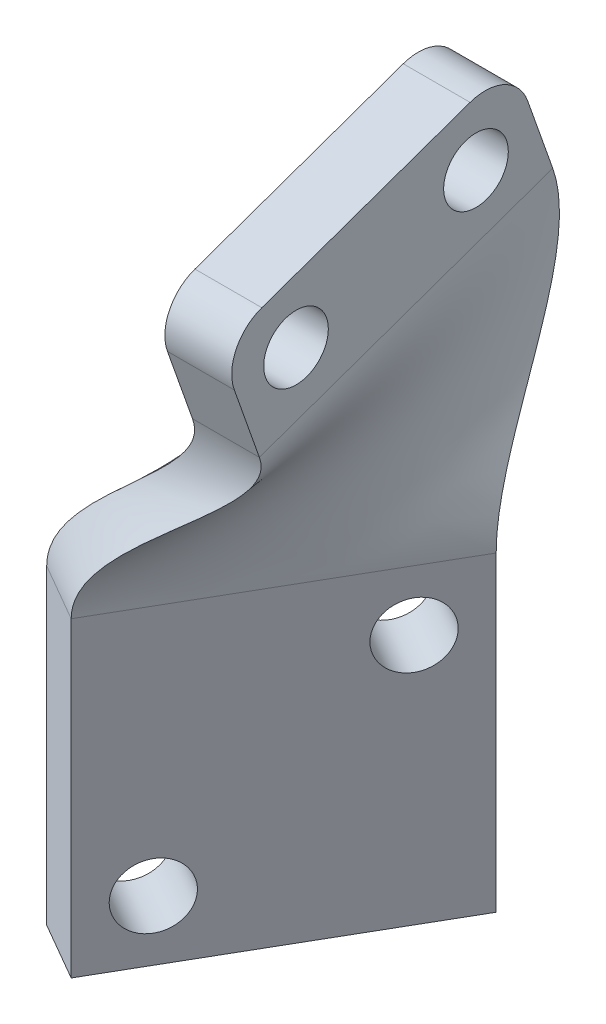
ISO-10303-21;
HEADER;
FILE_DESCRIPTION(('STEP AP214'),'2;1');
FILE_NAME('part.step','',(''),(''),'','','');
FILE_SCHEMA(('AUTOMOTIVE_DESIGN { 1 0 10303 214 1 1 1 1 }'));
ENDSEC;
DATA;
#1=APPLICATION_CONTEXT('core data for automotive mechanical design processes');
#2=APPLICATION_PROTOCOL_DEFINITION('international standard','automotive_design',2000,#1);
#3=PRODUCT_CONTEXT('',#1,'mechanical');
#4=PRODUCT('Part','Part','',(#3));
#5=PRODUCT_RELATED_PRODUCT_CATEGORY('part','',(#4));
#6=PRODUCT_DEFINITION_FORMATION('','',#4);
#7=PRODUCT_DEFINITION_CONTEXT('part definition',#1,'design');
#8=PRODUCT_DEFINITION('design','',#6,#7);
#9=PRODUCT_DEFINITION_SHAPE('','',#8);
#10=(LENGTH_UNIT() NAMED_UNIT(*) SI_UNIT(.MILLI.,.METRE.));
#11=(NAMED_UNIT(*) PLANE_ANGLE_UNIT() SI_UNIT($,.RADIAN.));
#12=(NAMED_UNIT(*) SI_UNIT($,.STERADIAN.) SOLID_ANGLE_UNIT());
#13=UNCERTAINTY_MEASURE_WITH_UNIT(LENGTH_MEASURE(1.E-05),#10,'distance_accuracy_value','');
#14=(GEOMETRIC_REPRESENTATION_CONTEXT(3) GLOBAL_UNCERTAINTY_ASSIGNED_CONTEXT((#13)) GLOBAL_UNIT_ASSIGNED_CONTEXT((#10,
#11,#12)) REPRESENTATION_CONTEXT('',''));
#15=CARTESIAN_POINT('',(0.,0.,0.));
#16=DIRECTION('',(0.,0.,1.));
#17=DIRECTION('',(1.,0.,0.));
#18=AXIS2_PLACEMENT_3D('',#15,#16,#17);
#19=CARTESIAN_POINT('',(32.1308414856879,0.,18.5507499810511));
#20=DIRECTION('',(0.866025403784438,0.,0.500000000000001));
#21=DIRECTION('',(-0.500000000000001,0.,0.866025403784438));
#22=AXIS2_PLACEMENT_3D('',#19,#20,#21);
#23=PLANE('',#22);
#24=CARTESIAN_POINT('',(-20.9871698093958,18.3679349444248,110.553844341153));
#25=DIRECTION('',(-0.866025403784438,0.,-0.5));
#26=DIRECTION('',(-0.5,0.,0.866025403784438));
#27=AXIS2_PLACEMENT_3D('',#24,#25,#26);
#28=CIRCLE('',#27,2.15000000000001);
#29=CARTESIAN_POINT('',(-22.0621698093958,18.3679349444248,112.41579895929));
#30=VERTEX_POINT('',#29);
#31=EDGE_CURVE('E308',#30,#30,#28,.T.);
#32=ORIENTED_EDGE('',*,*,#31,.T.);
#33=EDGE_LOOP('',(#32));
#34=FACE_BOUND('',#33,.T.);
#35=DIRECTION('',(0.,-1.,0.));
#36=VECTOR('',#35,1.);
#37=CARTESIAN_POINT('',(-18.9871698093958,22.3679349444248,107.089742726016));
#38=LINE('',#37,#36);
#39=CARTESIAN_POINT('',(-18.9871698093958,22.3679349444248,107.089742726016));
#40=VERTEX_POINT('',#39);
#41=CARTESIAN_POINT('',(-18.9871698093958,1.66793494442471,107.089742726016));
#42=VERTEX_POINT('',#41);
#43=EDGE_CURVE('E318',#40,#42,#38,.T.);
#44=ORIENTED_EDGE('',*,*,#43,.F.);
#45=DIRECTION('',(-0.500000000000001,0.,0.866025403784438));
#46=VECTOR('',#45,1.);
#47=CARTESIAN_POINT('',(32.1308414856879,22.3679349444248,18.5507499810511));
#48=LINE('',#47,#46);
#49=CARTESIAN_POINT('',(-29.3371698093958,22.3679349444248,125.016468584354));
#50=VERTEX_POINT('',#49);
#51=EDGE_CURVE('E152',#50,#40,#48,.F.);
#52=ORIENTED_EDGE('',*,*,#51,.F.);
#53=DIRECTION('',(0.,1.,0.));
#54=VECTOR('',#53,1.);
#55=CARTESIAN_POINT('',(-29.3371698093958,22.3679349444248,125.016468584354));
#56=LINE('',#55,#54);
#57=CARTESIAN_POINT('',(-29.3371698093958,1.66793494442472,125.016468584354));
#58=VERTEX_POINT('',#57);
#59=EDGE_CURVE('E317',#58,#50,#56,.T.);
#60=ORIENTED_EDGE('',*,*,#59,.F.);
#61=DIRECTION('',(-0.500000000000001,0.,0.866025403784438));
#62=VECTOR('',#61,1.);
#63=CARTESIAN_POINT('',(-18.9871698093958,1.66793494442471,107.089742726016));
#64=LINE('',#63,#62);
#65=EDGE_CURVE('E314',#42,#58,#64,.T.);
#66=ORIENTED_EDGE('',*,*,#65,.F.);
#67=EDGE_LOOP('',(#44,#52,#60,#66));
#68=FACE_BOUND('',#67,.T.);
#69=CARTESIAN_POINT('',(-27.3371698093958,5.66793494442471,121.552366969216));
#70=DIRECTION('',(-0.866025403784438,0.,-0.5));
#71=DIRECTION('',(-0.5,0.,0.866025403784438));
#72=AXIS2_PLACEMENT_3D('',#69,#70,#71);
#73=CIRCLE('',#72,2.14999999999999);
#74=CARTESIAN_POINT('',(-28.4121698093958,5.66793494442471,123.414321587352));
#75=VERTEX_POINT('',#74);
#76=EDGE_CURVE('E296',#75,#75,#73,.T.);
#77=ORIENTED_EDGE('',*,*,#76,.T.);
#78=EDGE_LOOP('',(#77));
#79=FACE_BOUND('',#78,.T.);
#80=ADVANCED_FACE('F45',(#34,#68,#79),#23,.T.);
#81=CARTESIAN_POINT('',(28.2770284388471,0.,16.3257499810511));
#82=DIRECTION('',(0.866025403784438,0.,0.500000000000001));
#83=DIRECTION('',(-0.500000000000001,0.,0.866025403784438));
#84=AXIS2_PLACEMENT_3D('',#81,#82,#83);
#85=PLANE('',#84);
#86=DIRECTION('',(0.,-1.,0.));
#87=VECTOR('',#86,1.);
#88=CARTESIAN_POINT('',(-22.8409828562366,22.3679349444248,104.864742726016));
#89=LINE('',#88,#87);
#90=CARTESIAN_POINT('',(-22.8409828562366,22.3679349444248,104.864742726016));
#91=VERTEX_POINT('',#90);
#92=CARTESIAN_POINT('',(-22.8409828562366,1.66793494442471,104.864742726016));
#93=VERTEX_POINT('',#92);
#94=EDGE_CURVE('E311',#91,#93,#89,.T.);
#95=ORIENTED_EDGE('',*,*,#94,.T.);
#96=DIRECTION('',(-0.500000000000001,0.,0.866025403784438));
#97=VECTOR('',#96,1.);
#98=CARTESIAN_POINT('',(-22.8409828562366,1.66793494442471,104.864742726016));
#99=LINE('',#98,#97);
#100=CARTESIAN_POINT('',(-33.1909828562366,1.66793494442472,122.791468584354));
#101=VERTEX_POINT('',#100);
#102=EDGE_CURVE('E319',#93,#101,#99,.T.);
#103=ORIENTED_EDGE('',*,*,#102,.T.);
#104=DIRECTION('',(0.,1.,0.));
#105=VECTOR('',#104,1.);
#106=CARTESIAN_POINT('',(-33.1909828562366,22.3679349444248,122.791468584354));
#107=LINE('',#106,#105);
#108=CARTESIAN_POINT('',(-33.1909828562366,22.3679349444248,122.791468584354));
#109=VERTEX_POINT('',#108);
#110=EDGE_CURVE('E322',#101,#109,#107,.T.);
#111=ORIENTED_EDGE('',*,*,#110,.T.);
#112=DIRECTION('',(-0.500000000000001,0.,0.866025403784438));
#113=VECTOR('',#112,1.);
#114=CARTESIAN_POINT('',(28.2770284388471,22.3679349444248,16.3257499810511));
#115=LINE('',#114,#113);
#116=EDGE_CURVE('E330',#109,#91,#115,.F.);
#117=ORIENTED_EDGE('',*,*,#116,.T.);
#118=EDGE_LOOP('',(#95,#103,#111,#117));
#119=FACE_BOUND('',#118,.T.);
#120=CARTESIAN_POINT('',(-24.8409828562366,18.3679349444248,108.328844341153));
#121=DIRECTION('',(-0.866025403784438,0.,-0.5));
#122=DIRECTION('',(-0.5,0.,0.866025403784438));
#123=AXIS2_PLACEMENT_3D('',#120,#121,#122);
#124=CIRCLE('',#123,2.15000000000001);
#125=CARTESIAN_POINT('',(-25.9159828562366,18.3679349444248,110.19079895929));
#126=VERTEX_POINT('',#125);
#127=EDGE_CURVE('E304',#126,#126,#124,.T.);
#128=ORIENTED_EDGE('',*,*,#127,.F.);
#129=EDGE_LOOP('',(#128));
#130=FACE_BOUND('',#129,.T.);
#131=CARTESIAN_POINT('',(-31.1909828562366,5.66793494442472,119.327366969216));
#132=DIRECTION('',(-0.866025403784438,0.,-0.5));
#133=DIRECTION('',(-0.5,0.,0.866025403784438));
#134=AXIS2_PLACEMENT_3D('',#131,#132,#133);
#135=CIRCLE('',#134,2.14999999999999);
#136=CARTESIAN_POINT('',(-32.2659828562366,5.66793494442472,121.189321587352));
#137=VERTEX_POINT('',#136);
#138=EDGE_CURVE('E305',#137,#137,#135,.T.);
#139=ORIENTED_EDGE('',*,*,#138,.F.);
#140=EDGE_LOOP('',(#139));
#141=FACE_BOUND('',#140,.T.);
#142=ADVANCED_FACE('F348',(#119,#130,#141),#85,.F.);
#143=CARTESIAN_POINT('',(-18.9871698093958,22.3679349444248,107.089742726016));
#144=DIRECTION('',(-0.500000000000001,0.,0.866025403784438));
#145=DIRECTION('',(-0.866025403784438,0.,-0.500000000000001));
#146=AXIS2_PLACEMENT_3D('',#143,#144,#145);
#147=PLANE('',#146);
#148=ORIENTED_EDGE('',*,*,#94,.F.);
#149=DIRECTION('',(-0.866025403784438,0.,-0.500000000000001));
#150=VECTOR('',#149,1.);
#151=CARTESIAN_POINT('',(-18.9871698093958,22.3679349444248,107.089742726016));
#152=LINE('',#151,#150);
#153=EDGE_CURVE('E341',#40,#91,#152,.T.);
#154=ORIENTED_EDGE('',*,*,#153,.F.);
#155=ORIENTED_EDGE('',*,*,#43,.T.);
#156=DIRECTION('',(-0.866025403784438,0.,-0.500000000000001));
#157=VECTOR('',#156,1.);
#158=CARTESIAN_POINT('',(-18.9871698093958,1.66793494442471,107.089742726016));
#159=LINE('',#158,#157);
#160=EDGE_CURVE('E325',#42,#93,#159,.T.);
#161=ORIENTED_EDGE('',*,*,#160,.T.);
#162=EDGE_LOOP('',(#148,#154,#155,#161));
#163=FACE_BOUND('',#162,.T.);
#164=ADVANCED_FACE('F351',(#163),#147,.F.);
#165=CARTESIAN_POINT('',(-18.9871698093958,1.66793494442471,107.089742726016));
#166=DIRECTION('',(0.,1.,0.));
#167=DIRECTION('',(-1.,0.,0.));
#168=AXIS2_PLACEMENT_3D('',#165,#166,#167);
#169=PLANE('',#168);
#170=ORIENTED_EDGE('',*,*,#102,.F.);
#171=ORIENTED_EDGE('',*,*,#160,.F.);
#172=ORIENTED_EDGE('',*,*,#65,.T.);
#173=DIRECTION('',(-0.866025403784438,0.,-0.500000000000001));
#174=VECTOR('',#173,1.);
#175=CARTESIAN_POINT('',(-29.3371698093958,1.66793494442472,125.016468584354));
#176=LINE('',#175,#174);
#177=EDGE_CURVE('E323',#58,#101,#176,.T.);
#178=ORIENTED_EDGE('',*,*,#177,.T.);
#179=EDGE_LOOP('',(#170,#171,#172,#178));
#180=FACE_BOUND('',#179,.T.);
#181=ADVANCED_FACE('F355',(#180),#169,.F.);
#182=CARTESIAN_POINT('',(-29.3371698093958,22.3679349444248,125.016468584354));
#183=DIRECTION('',(0.500000000000001,0.,-0.866025403784438));
#184=DIRECTION('',(0.866025403784438,0.,0.500000000000001));
#185=AXIS2_PLACEMENT_3D('',#182,#183,#184);
#186=PLANE('',#185);
#187=ORIENTED_EDGE('',*,*,#110,.F.);
#188=ORIENTED_EDGE('',*,*,#177,.F.);
#189=ORIENTED_EDGE('',*,*,#59,.T.);
#190=DIRECTION('',(0.866025403784438,0.,0.500000000000001));
#191=VECTOR('',#190,1.);
#192=CARTESIAN_POINT('',(-29.3371698093958,22.3679349444248,125.016468584354));
#193=LINE('',#192,#191);
#194=EDGE_CURVE('E326',#50,#109,#193,.F.);
#195=ORIENTED_EDGE('',*,*,#194,.T.);
#196=EDGE_LOOP('',(#187,#188,#189,#195));
#197=FACE_BOUND('',#196,.T.);
#198=ADVANCED_FACE('F358',(#197),#186,.F.);
#199=CARTESIAN_POINT('',(-20.9871698093958,18.3679349444248,110.553844341153));
#200=DIRECTION('',(-0.866025403784438,0.,-0.500000000000001));
#201=DIRECTION('',(0.500000000000001,0.,-0.866025403784438));
#202=AXIS2_PLACEMENT_3D('',#199,#200,#201);
#203=CYLINDRICAL_SURFACE('',#202,2.15000000000001);
#204=ORIENTED_EDGE('',*,*,#31,.F.);
#205=EDGE_LOOP('',(#204));
#206=FACE_BOUND('',#205,.T.);
#207=ORIENTED_EDGE('',*,*,#127,.T.);
#208=EDGE_LOOP('',(#207));
#209=FACE_BOUND('',#208,.T.);
#210=ADVANCED_FACE('F406',(#206,#209),#203,.F.);
#211=CARTESIAN_POINT('',(-27.3371698093958,5.66793494442471,121.552366969216));
#212=DIRECTION('',(-0.866025403784438,0.,-0.500000000000001));
#213=DIRECTION('',(0.500000000000001,0.,-0.866025403784438));
#214=AXIS2_PLACEMENT_3D('',#211,#212,#213);
#215=CYLINDRICAL_SURFACE('',#214,2.14999999999999);
#216=ORIENTED_EDGE('',*,*,#76,.F.);
#217=EDGE_LOOP('',(#216));
#218=FACE_BOUND('',#217,.T.);
#219=ORIENTED_EDGE('',*,*,#138,.T.);
#220=EDGE_LOOP('',(#219));
#221=FACE_BOUND('',#220,.T.);
#222=ADVANCED_FACE('F283',(#218,#221),#215,.F.);
#223=CARTESIAN_POINT('',(-19.9264999621046,34.817114234562,121.906255403122));
#224=CARTESIAN_POINT('',(-19.9264999621046,30.4714416580797,120.369828129298));
#225=CARTESIAN_POINT('',(-29.3371698093958,27.2103791955216,125.016468584354));
#226=CARTESIAN_POINT('',(-29.3371698093958,22.3679349444248,125.016468584354));
#227=CARTESIAN_POINT('',(-19.9264999621046,35.967114234562,118.653564209663));
#228=CARTESIAN_POINT('',(-19.9264999621046,31.4653412623536,117.061947111658));
#229=CARTESIAN_POINT('',(-27.6121698093958,27.3964914394871,122.028680941297));
#230=CARTESIAN_POINT('',(-27.6121698093958,22.3679349444248,122.028680941297));
#231=CARTESIAN_POINT('',(-19.9264999621046,38.267114234562,112.148181822747));
#232=CARTESIAN_POINT('',(-19.9264999621046,33.4531404709013,110.446185076378));
#233=CARTESIAN_POINT('',(-24.1621698093958,27.7687159274181,116.053105655185));
#234=CARTESIAN_POINT('',(-24.1621698093958,22.3679349444248,116.053105655185));
#235=CARTESIAN_POINT('',(-19.9264999621046,40.567114234562,105.642799435831));
#236=CARTESIAN_POINT('',(-19.9264999621046,35.0590710795491,103.695412102842));
#237=CARTESIAN_POINT('',(-20.7121698093958,28.5459732301163,110.077530369072));
#238=CARTESIAN_POINT('',(-20.7121698093958,22.3679349444248,110.077530369072));
#239=CARTESIAN_POINT('',(-19.9264999621046,41.717114234562,102.390108242373));
#240=CARTESIAN_POINT('',(-19.9264999621046,35.862036383873,100.320025616074));
#241=CARTESIAN_POINT('',(-18.9871698093958,28.9346018814654,107.089742726016));
#242=CARTESIAN_POINT('',(-18.9871698093958,22.3679349444248,107.089742726016));
#243=B_SPLINE_SURFACE_WITH_KNOTS('',3,3,((#223,#224,#225,#226),(#227,#228,#229,#230),(#231,#232,
#233,#234),(#235,#236,#237,#238),(#239,#240,#241,#242)),.UNSPECIFIED.,.F.,.F.,.F.,(4,1,4),(4,4),
(0.,0.5,1.),(0.,1.),.UNSPECIFIED.);
#244=CARTESIAN_POINT('',(-19.9264999621046,41.717114234562,102.390108242373));
#245=CARTESIAN_POINT('',(-19.9264999621046,40.567114234562,105.642799435831));
#246=CARTESIAN_POINT('',(-19.9264999621046,38.267114234562,112.148181822747));
#247=CARTESIAN_POINT('',(-19.9264999621046,35.967114234562,118.653564209663));
#248=CARTESIAN_POINT('',(-19.9264999621046,34.817114234562,121.906255403122));
#249=B_SPLINE_CURVE_WITH_KNOTS('',3,(#244,#245,#246,#247,#248),.UNSPECIFIED.,.F.,.F.,(4,1,4),
(0.,0.5,1.),.UNSPECIFIED.);
#250=CARTESIAN_POINT('',(-19.9264999621046,34.817114234562,121.906255403122));
#251=VERTEX_POINT('',#250);
#252=CARTESIAN_POINT('',(-19.9264999621046,41.717114234562,102.390108242373));
#253=VERTEX_POINT('',#252);
#254=EDGE_CURVE('E143',#251,#253,#249,.F.);
#255=CARTESIAN_POINT('',(-19.9264999621046,34.817114234562,121.906255403122));
#256=CARTESIAN_POINT('',(-19.9264999621046,30.4714416580797,120.369828129298));
#257=CARTESIAN_POINT('',(-29.3371698093958,27.2103791955216,125.016468584354));
#258=CARTESIAN_POINT('',(-29.3371698093958,22.3679349444248,125.016468584354));
#259=B_SPLINE_CURVE_WITH_KNOTS('',3,(#255,#256,#257,#258),.UNSPECIFIED.,.F.,.F.,(4,4),(0.,1.),.UNSPECIFIED.);
#260=EDGE_CURVE('E154',#50,#251,#259,.F.);
#261=CARTESIAN_POINT('',(-19.9264999621046,41.717114234562,102.390108242373));
#262=CARTESIAN_POINT('',(-19.9264999621046,35.862036383873,100.320025616074));
#263=CARTESIAN_POINT('',(-18.9871698093958,28.9346018814654,107.089742726016));
#264=CARTESIAN_POINT('',(-18.9871698093958,22.3679349444248,107.089742726016));
#265=B_SPLINE_CURVE_WITH_KNOTS('',3,(#261,#262,#263,#264),.UNSPECIFIED.,.F.,.F.,(4,4),(0.,1.),.UNSPECIFIED.);
#266=EDGE_CURVE('E139',#253,#40,#265,.T.);
#267=ORIENTED_EDGE('',*,*,#254,.F.);
#268=ORIENTED_EDGE('',*,*,#260,.F.);
#269=ORIENTED_EDGE('',*,*,#51,.T.);
#270=ORIENTED_EDGE('',*,*,#266,.F.);
#271=EDGE_LOOP('',(#267,#268,#269,#270));
#272=FACE_BOUND('',#271,.T.);
#273=ADVANCED_FACE('F149',(#272),#243,.F.);
#274=CARTESIAN_POINT('',(-19.9264999621046,41.717114234562,102.390108242373));
#275=CARTESIAN_POINT('',(-19.9264999621046,35.862036383873,100.320025616074));
#276=CARTESIAN_POINT('',(-18.9871698093958,28.9346018814654,107.089742726016));
#277=CARTESIAN_POINT('',(-18.9871698093958,22.3679349444248,107.089742726016));
#278=CARTESIAN_POINT('',(-20.6681666287712,41.717114234562,102.390108242373));
#279=CARTESIAN_POINT('',(-20.6681666287712,35.8611119832379,100.319698791095));
#280=CARTESIAN_POINT('',(-19.6294719838693,28.9191008749203,106.718909392682));
#281=CARTESIAN_POINT('',(-19.6294719838693,22.3679349444248,106.718909392682));
#282=CARTESIAN_POINT('',(-22.1514999621046,41.717114234562,102.390108242373));
#283=CARTESIAN_POINT('',(-22.1514999621046,35.8592631819678,100.319045141138));
#284=CARTESIAN_POINT('',(-20.9140763328162,28.8880988618301,105.977242726016));
#285=CARTESIAN_POINT('',(-20.9140763328162,22.3679349444248,105.977242726016));
#286=CARTESIAN_POINT('',(-23.6348332954379,41.717114234562,102.390108242373));
#287=CARTESIAN_POINT('',(-23.6348332954379,35.8450606859141,100.314023800503));
#288=CARTESIAN_POINT('',(-22.1986806817631,28.8701999207712,105.235576059349));
#289=CARTESIAN_POINT('',(-22.1986806817631,22.3679349444248,105.235576059349));
#290=CARTESIAN_POINT('',(-24.3764999621046,41.717114234562,102.390108242373));
#291=CARTESIAN_POINT('',(-24.3764999621046,35.8379594378872,100.311513130186));
#292=CARTESIAN_POINT('',(-22.8409828562366,28.8612504502417,104.864742726016));
#293=CARTESIAN_POINT('',(-22.8409828562366,22.3679349444248,104.864742726016));
#294=B_SPLINE_SURFACE_WITH_KNOTS('',3,3,((#274,#275,#276,#277),(#278,#279,#280,#281),(#282,#283,
#284,#285),(#286,#287,#288,#289),(#290,#291,#292,#293)),.UNSPECIFIED.,.F.,.F.,.F.,(4,1,4),(4,4),
(0.,0.5,1.),(0.,1.),.UNSPECIFIED.);
#295=CARTESIAN_POINT('',(-24.3764999621046,41.717114234562,102.390108242373));
#296=CARTESIAN_POINT('',(-23.6348332954379,41.717114234562,102.390108242373));
#297=CARTESIAN_POINT('',(-22.1514999621046,41.717114234562,102.390108242373));
#298=CARTESIAN_POINT('',(-20.6681666287712,41.717114234562,102.390108242373));
#299=CARTESIAN_POINT('',(-19.9264999621046,41.717114234562,102.390108242373));
#300=B_SPLINE_CURVE_WITH_KNOTS('',3,(#295,#296,#297,#298,#299),.UNSPECIFIED.,.F.,.F.,(4,1,4),
(0.,0.5,1.),.UNSPECIFIED.);
#301=CARTESIAN_POINT('',(-24.3764999621046,41.717114234562,102.390108242373));
#302=VERTEX_POINT('',#301);
#303=EDGE_CURVE('E125',#302,#253,#300,.T.);
#304=CARTESIAN_POINT('',(-24.3764999621046,41.717114234562,102.390108242373));
#305=CARTESIAN_POINT('',(-24.3764999621046,35.8379594378872,100.311513130186));
#306=CARTESIAN_POINT('',(-22.8409828562366,28.8612504502417,104.864742726016));
#307=CARTESIAN_POINT('',(-22.8409828562366,22.3679349444248,104.864742726016));
#308=B_SPLINE_CURVE_WITH_KNOTS('',3,(#304,#305,#306,#307),.UNSPECIFIED.,.F.,.F.,(4,4),(0.,1.),.UNSPECIFIED.);
#309=EDGE_CURVE('E141',#302,#91,#308,.T.);
#310=ORIENTED_EDGE('',*,*,#303,.T.);
#311=ORIENTED_EDGE('',*,*,#266,.T.);
#312=ORIENTED_EDGE('',*,*,#153,.T.);
#313=ORIENTED_EDGE('',*,*,#309,.F.);
#314=EDGE_LOOP('',(#310,#311,#312,#313));
#315=FACE_BOUND('',#314,.T.);
#316=ADVANCED_FACE('F137',(#315),#294,.F.);
#317=CARTESIAN_POINT('',(-24.3764999621046,34.817114234562,121.906255403122));
#318=CARTESIAN_POINT('',(-24.3764999621046,30.4976330179452,120.379088173383));
#319=CARTESIAN_POINT('',(-33.1909828562366,27.0837101743787,122.791468584354));
#320=CARTESIAN_POINT('',(-33.1909828562366,22.3679349444248,122.791468584354));
#321=CARTESIAN_POINT('',(-23.6348332954379,34.817114234562,121.906255403122));
#322=CARTESIAN_POINT('',(-23.6348332954379,30.4969788665021,120.378856895922));
#323=CARTESIAN_POINT('',(-32.5486806817631,27.1008854882421,123.162301917687));
#324=CARTESIAN_POINT('',(-32.5486806817631,22.3679349444248,123.162301917687));
#325=CARTESIAN_POINT('',(-22.1514999621046,34.817114234562,121.906255403122));
#326=CARTESIAN_POINT('',(-22.1514999621046,30.495670563616,120.378394341001));
#327=CARTESIAN_POINT('',(-31.2640763328162,27.135236115969,123.903968584354));
#328=CARTESIAN_POINT('',(-31.2640763328162,22.3679349444248,123.903968584354));
#329=CARTESIAN_POINT('',(-20.6681666287713,34.817114234562,121.906255403122));
#330=CARTESIAN_POINT('',(-20.6681666287713,30.4795179599251,120.372683533199));
#331=CARTESIAN_POINT('',(-29.9794719838693,27.1853315023374,124.64563525102));
#332=CARTESIAN_POINT('',(-29.9794719838693,22.3679349444248,124.64563525102));
#333=CARTESIAN_POINT('',(-19.9264999621046,34.817114234562,121.906255403122));
#334=CARTESIAN_POINT('',(-19.9264999621046,30.4714416580797,120.369828129298));
#335=CARTESIAN_POINT('',(-29.3371698093958,27.2103791955216,125.016468584354));
#336=CARTESIAN_POINT('',(-29.3371698093958,22.3679349444248,125.016468584354));
#337=B_SPLINE_SURFACE_WITH_KNOTS('',3,3,((#317,#318,#319,#320),(#321,#322,#323,#324),(#325,#326,
#327,#328),(#329,#330,#331,#332),(#333,#334,#335,#336)),.UNSPECIFIED.,.F.,.F.,.F.,(4,1,4),(4,4),
(0.,0.5,1.),(0.,1.),.UNSPECIFIED.);
#338=CARTESIAN_POINT('',(-19.9264999621046,34.817114234562,121.906255403122));
#339=CARTESIAN_POINT('',(-20.6681666287713,34.817114234562,121.906255403122));
#340=CARTESIAN_POINT('',(-22.1514999621046,34.817114234562,121.906255403122));
#341=CARTESIAN_POINT('',(-23.6348332954379,34.817114234562,121.906255403122));
#342=CARTESIAN_POINT('',(-24.3764999621046,34.817114234562,121.906255403122));
#343=B_SPLINE_CURVE_WITH_KNOTS('',3,(#338,#339,#340,#341,#342),.UNSPECIFIED.,.F.,.F.,(4,1,4),
(0.,0.5,1.),.UNSPECIFIED.);
#344=CARTESIAN_POINT('',(-24.3764999621046,34.817114234562,121.906255403122));
#345=VERTEX_POINT('',#344);
#346=EDGE_CURVE('E249',#345,#251,#343,.F.);
#347=CARTESIAN_POINT('',(-24.3764999621046,34.817114234562,121.906255403122));
#348=CARTESIAN_POINT('',(-24.3764999621046,30.4976330179452,120.379088173383));
#349=CARTESIAN_POINT('',(-33.1909828562366,27.0837101743787,122.791468584354));
#350=CARTESIAN_POINT('',(-33.1909828562366,22.3679349444248,122.791468584354));
#351=B_SPLINE_CURVE_WITH_KNOTS('',3,(#347,#348,#349,#350),.UNSPECIFIED.,.F.,.F.,(4,4),(0.,1.),.UNSPECIFIED.);
#352=EDGE_CURVE('E254',#345,#109,#351,.T.);
#353=ORIENTED_EDGE('',*,*,#346,.F.);
#354=ORIENTED_EDGE('',*,*,#352,.T.);
#355=ORIENTED_EDGE('',*,*,#194,.F.);
#356=ORIENTED_EDGE('',*,*,#260,.T.);
#357=EDGE_LOOP('',(#353,#354,#355,#356));
#358=FACE_BOUND('',#357,.T.);
#359=ADVANCED_FACE('F256',(#358),#337,.F.);
#360=CARTESIAN_POINT('',(-24.3764999621046,41.717114234562,102.390108242373));
#361=CARTESIAN_POINT('',(-24.3764999621046,35.8379594378872,100.311513130186));
#362=CARTESIAN_POINT('',(-22.8409828562366,28.8612504502417,104.864742726016));
#363=CARTESIAN_POINT('',(-22.8409828562366,22.3679349444248,104.864742726016));
#364=CARTESIAN_POINT('',(-24.3764999621046,40.567114234562,105.642799435831));
#365=CARTESIAN_POINT('',(-24.3764999621046,35.0446910383115,103.690327990506));
#366=CARTESIAN_POINT('',(-24.5659828562366,28.4623366782367,107.852530369072));
#367=CARTESIAN_POINT('',(-24.5659828562366,22.3679349444248,107.852530369072));
#368=CARTESIAN_POINT('',(-24.3764999621046,38.267114234562,112.148181822747));
#369=CARTESIAN_POINT('',(-24.3764999621046,33.4581542391601,110.447957711145));
#370=CARTESIAN_POINT('',(-28.0159828562366,27.6645091342266,113.828105655185));
#371=CARTESIAN_POINT('',(-28.0159828562366,22.3679349444248,113.828105655185));
#372=CARTESIAN_POINT('',(-24.3764999621046,35.967114234562,118.653564209663));
#373=CARTESIAN_POINT('',(-24.3764999621046,31.4844734250168,117.068711352637));
#374=CARTESIAN_POINT('',(-31.4659828562366,27.2773098276613,119.803680941297));
#375=CARTESIAN_POINT('',(-31.4659828562366,22.3679349444248,119.803680941297));
#376=CARTESIAN_POINT('',(-24.3764999621046,34.817114234562,121.906255403122));
#377=CARTESIAN_POINT('',(-24.3764999621046,30.4976330179452,120.379088173383));
#378=CARTESIAN_POINT('',(-33.1909828562366,27.0837101743787,122.791468584354));
#379=CARTESIAN_POINT('',(-33.1909828562366,22.3679349444248,122.791468584354));
#380=B_SPLINE_SURFACE_WITH_KNOTS('',3,3,((#360,#361,#362,#363),(#364,#365,#366,#367),(#368,#369,
#370,#371),(#372,#373,#374,#375),(#376,#377,#378,#379)),.UNSPECIFIED.,.F.,.F.,.F.,(4,1,4),(4,4),
(0.,0.5,1.),(0.,1.),.UNSPECIFIED.);
#381=CARTESIAN_POINT('',(-24.3764999621046,34.817114234562,121.906255403122));
#382=CARTESIAN_POINT('',(-24.3764999621046,35.967114234562,118.653564209663));
#383=CARTESIAN_POINT('',(-24.3764999621046,38.267114234562,112.148181822747));
#384=CARTESIAN_POINT('',(-24.3764999621046,40.567114234562,105.642799435831));
#385=CARTESIAN_POINT('',(-24.3764999621046,41.717114234562,102.390108242373));
#386=B_SPLINE_CURVE_WITH_KNOTS('',3,(#381,#382,#383,#384,#385),.UNSPECIFIED.,.F.,.F.,(4,1,4),
(0.,0.5,1.),.UNSPECIFIED.);
#387=EDGE_CURVE('E142',#345,#302,#386,.T.);
#388=ORIENTED_EDGE('',*,*,#387,.T.);
#389=ORIENTED_EDGE('',*,*,#309,.T.);
#390=ORIENTED_EDGE('',*,*,#116,.F.);
#391=ORIENTED_EDGE('',*,*,#352,.F.);
#392=EDGE_LOOP('',(#388,#389,#390,#391));
#393=FACE_BOUND('',#392,.T.);
#394=ADVANCED_FACE('F268',(#393),#380,.F.);
#395=CARTESIAN_POINT('',(-24.3764999621045,0.,0.));
#396=DIRECTION('',(1.,0.,0.));
#397=DIRECTION('',(0.,0.,1.));
#398=AXIS2_PLACEMENT_3D('',#395,#396,#397);
#399=PLANE('',#398);
#400=DIRECTION('',(0.,0.942809041582063,0.333333333333335));
#401=VECTOR('',#400,1.);
#402=CARTESIAN_POINT('',(-24.3764999621046,49.2595865672185,105.05677490904));
#403=LINE('',#402,#401);
#404=CARTESIAN_POINT('',(-24.3764999621046,46.4311594424723,104.05677490904));
#405=VERTEX_POINT('',#404);
#406=EDGE_CURVE('E202',#302,#405,#403,.T.);
#407=ORIENTED_EDGE('',*,*,#406,.F.);
#408=ORIENTED_EDGE('',*,*,#387,.F.);
#409=DIRECTION('',(0.,-0.942809041582063,-0.333333333333334));
#410=VECTOR('',#409,1.);
#411=CARTESIAN_POINT('',(-24.3764999621046,34.817114234562,121.906255403122));
#412=LINE('',#411,#410);
#413=CARTESIAN_POINT('',(-24.3764999621046,39.5311594424723,123.572922069788));
#414=VERTEX_POINT('',#413);
#415=EDGE_CURVE('E209',#414,#345,#412,.T.);
#416=ORIENTED_EDGE('',*,*,#415,.F.);
#417=CARTESIAN_POINT('',(-24.3764999621046,40.5311594424723,120.744494945042));
#418=DIRECTION('',(-1.,0.,0.));
#419=DIRECTION('',(0.,0.,1.));
#420=AXIS2_PLACEMENT_3D('',#417,#418,#419);
#421=CIRCLE('',#420,3.);
#422=CARTESIAN_POINT('',(-24.3764999621046,43.3595865672185,121.744494945042));
#423=VERTEX_POINT('',#422);
#424=EDGE_CURVE('E232',#423,#414,#421,.F.);
#425=ORIENTED_EDGE('',*,*,#424,.F.);
#426=DIRECTION('',(0.,-0.333333333333334,0.942809041582063));
#427=VECTOR('',#426,1.);
#428=CARTESIAN_POINT('',(-24.3764999621046,42.3595865672185,124.572922069788));
#429=LINE('',#428,#427);
#430=CARTESIAN_POINT('',(-24.3764999621046,48.2595865672185,107.885202033786));
#431=VERTEX_POINT('',#430);
#432=EDGE_CURVE('E162',#431,#423,#429,.T.);
#433=ORIENTED_EDGE('',*,*,#432,.F.);
#434=CARTESIAN_POINT('',(-24.3764999621046,45.4311594424723,106.885202033786));
#435=DIRECTION('',(-1.,0.,0.));
#436=DIRECTION('',(0.,0.,1.));
#437=AXIS2_PLACEMENT_3D('',#434,#435,#436);
#438=CIRCLE('',#437,3.);
#439=EDGE_CURVE('E53',#405,#431,#438,.F.);
#440=ORIENTED_EDGE('',*,*,#439,.F.);
#441=EDGE_LOOP('',(#407,#408,#416,#425,#433,#440));
#442=FACE_BOUND('',#441,.T.);
#443=CARTESIAN_POINT('',(-24.3764999621046,44.1550170675569,107.494677742034));
#444=DIRECTION('',(1.,0.,0.));
#445=DIRECTION('',(0.,0.,-1.));
#446=AXIS2_PLACEMENT_3D('',#443,#444,#445);
#447=CIRCLE('',#446,2.15);
#448=CARTESIAN_POINT('',(-24.3764999621046,44.1550170675569,105.344677742034));
#449=VERTEX_POINT('',#448);
#450=EDGE_CURVE('E737',#449,#449,#447,.T.);
#451=ORIENTED_EDGE('',*,*,#450,.T.);
#452=EDGE_LOOP('',(#451));
#453=FACE_BOUND('',#452,.T.);
#454=CARTESIAN_POINT('',(-24.3764999621046,39.9216837342236,119.468352570127));
#455=DIRECTION('',(1.,0.,0.));
#456=DIRECTION('',(0.,0.,-1.));
#457=AXIS2_PLACEMENT_3D('',#454,#455,#456);
#458=CIRCLE('',#457,2.15);
#459=CARTESIAN_POINT('',(-24.3764999621046,39.9216837342236,117.318352570127));
#460=VERTEX_POINT('',#459);
#461=EDGE_CURVE('E741',#460,#460,#458,.T.);
#462=ORIENTED_EDGE('',*,*,#461,.T.);
#463=EDGE_LOOP('',(#462));
#464=FACE_BOUND('',#463,.T.);
#465=ADVANCED_FACE('F183',(#442,#453,#464),#399,.F.);
#466=CARTESIAN_POINT('',(-19.9264999621045,0.,0.));
#467=DIRECTION('',(1.,0.,0.));
#468=DIRECTION('',(0.,0.,1.));
#469=AXIS2_PLACEMENT_3D('',#466,#467,#468);
#470=PLANE('',#469);
#471=CARTESIAN_POINT('',(-19.9264999621046,44.1550170675569,107.494677742034));
#472=DIRECTION('',(1.,0.,0.));
#473=DIRECTION('',(0.,0.,-1.));
#474=AXIS2_PLACEMENT_3D('',#471,#472,#473);
#475=CIRCLE('',#474,2.15);
#476=CARTESIAN_POINT('',(-19.9264999621046,44.1550170675569,105.344677742034));
#477=VERTEX_POINT('',#476);
#478=EDGE_CURVE('E242',#477,#477,#475,.T.);
#479=ORIENTED_EDGE('',*,*,#478,.F.);
#480=EDGE_LOOP('',(#479));
#481=FACE_BOUND('',#480,.T.);
#482=DIRECTION('',(0.,-0.333333333333334,0.942809041582063));
#483=VECTOR('',#482,1.);
#484=CARTESIAN_POINT('',(-19.9264999621046,42.3595865672185,124.572922069788));
#485=LINE('',#484,#483);
#486=CARTESIAN_POINT('',(-19.9264999621046,48.2595865672185,107.885202033786));
#487=VERTEX_POINT('',#486);
#488=CARTESIAN_POINT('',(-19.9264999621046,43.3595865672185,121.744494945042));
#489=VERTEX_POINT('',#488);
#490=EDGE_CURVE('E130',#487,#489,#485,.T.);
#491=ORIENTED_EDGE('',*,*,#490,.T.);
#492=CARTESIAN_POINT('',(-19.9264999621046,40.5311594424723,120.744494945042));
#493=DIRECTION('',(-1.,0.,0.));
#494=DIRECTION('',(0.,0.,1.));
#495=AXIS2_PLACEMENT_3D('',#492,#493,#494);
#496=CIRCLE('',#495,3.);
#497=CARTESIAN_POINT('',(-19.9264999621046,39.5311594424723,123.572922069788));
#498=VERTEX_POINT('',#497);
#499=EDGE_CURVE('E732',#498,#489,#496,.T.);
#500=ORIENTED_EDGE('',*,*,#499,.F.);
#501=DIRECTION('',(0.,-0.942809041582063,-0.333333333333334));
#502=VECTOR('',#501,1.);
#503=CARTESIAN_POINT('',(-19.9264999621046,34.817114234562,121.906255403122));
#504=LINE('',#503,#502);
#505=EDGE_CURVE('E131',#498,#251,#504,.T.);
#506=ORIENTED_EDGE('',*,*,#505,.T.);
#507=ORIENTED_EDGE('',*,*,#254,.T.);
#508=DIRECTION('',(0.,0.942809041582063,0.333333333333335));
#509=VECTOR('',#508,1.);
#510=CARTESIAN_POINT('',(-19.9264999621046,49.2595865672185,105.05677490904));
#511=LINE('',#510,#509);
#512=CARTESIAN_POINT('',(-19.9264999621046,46.4311594424723,104.05677490904));
#513=VERTEX_POINT('',#512);
#514=EDGE_CURVE('E121',#253,#513,#511,.T.);
#515=ORIENTED_EDGE('',*,*,#514,.T.);
#516=CARTESIAN_POINT('',(-19.9264999621046,45.4311594424723,106.885202033786));
#517=DIRECTION('',(-1.,0.,0.));
#518=DIRECTION('',(0.,0.,1.));
#519=AXIS2_PLACEMENT_3D('',#516,#517,#518);
#520=CIRCLE('',#519,3.);
#521=EDGE_CURVE('E734',#487,#513,#520,.T.);
#522=ORIENTED_EDGE('',*,*,#521,.F.);
#523=EDGE_LOOP('',(#491,#500,#506,#507,#515,#522));
#524=FACE_BOUND('',#523,.T.);
#525=CARTESIAN_POINT('',(-19.9264999621046,39.9216837342236,119.468352570127));
#526=DIRECTION('',(1.,0.,0.));
#527=DIRECTION('',(0.,0.,-1.));
#528=AXIS2_PLACEMENT_3D('',#525,#526,#527);
#529=CIRCLE('',#528,2.15);
#530=CARTESIAN_POINT('',(-19.9264999621046,39.9216837342236,117.318352570127));
#531=VERTEX_POINT('',#530);
#532=EDGE_CURVE('E743',#531,#531,#529,.T.);
#533=ORIENTED_EDGE('',*,*,#532,.F.);
#534=EDGE_LOOP('',(#533));
#535=FACE_BOUND('',#534,.T.);
#536=ADVANCED_FACE('F158',(#481,#524,#535),#470,.T.);
#537=CARTESIAN_POINT('',(-24.3764999621046,34.817114234562,121.906255403122));
#538=DIRECTION('',(0.,0.333333333333334,-0.942809041582063));
#539=DIRECTION('',(0.,-0.942809041582063,-0.333333333333334));
#540=AXIS2_PLACEMENT_3D('',#537,#538,#539);
#541=PLANE('',#540);
#542=ORIENTED_EDGE('',*,*,#415,.T.);
#543=ORIENTED_EDGE('',*,*,#346,.T.);
#544=ORIENTED_EDGE('',*,*,#505,.F.);
#545=DIRECTION('',(1.,0.,0.));
#546=VECTOR('',#545,1.);
#547=CARTESIAN_POINT('',(-24.3764999621046,39.5311594424723,123.572922069788));
#548=LINE('',#547,#546);
#549=EDGE_CURVE('E12',#414,#498,#548,.T.);
#550=ORIENTED_EDGE('',*,*,#549,.F.);
#551=EDGE_LOOP('',(#542,#543,#544,#550));
#552=FACE_BOUND('',#551,.T.);
#553=ADVANCED_FACE('F182',(#552),#541,.F.);
#554=CARTESIAN_POINT('',(-24.3764999621046,49.2595865672185,105.05677490904));
#555=DIRECTION('',(0.,-0.333333333333335,0.942809041582063));
#556=DIRECTION('',(0.,0.942809041582063,0.333333333333335));
#557=AXIS2_PLACEMENT_3D('',#554,#555,#556);
#558=PLANE('',#557);
#559=ORIENTED_EDGE('',*,*,#514,.F.);
#560=ORIENTED_EDGE('',*,*,#303,.F.);
#561=ORIENTED_EDGE('',*,*,#406,.T.);
#562=DIRECTION('',(1.,0.,0.));
#563=VECTOR('',#562,1.);
#564=CARTESIAN_POINT('',(-24.3764999621046,46.4311594424723,104.05677490904));
#565=LINE('',#564,#563);
#566=EDGE_CURVE('E66',#513,#405,#565,.F.);
#567=ORIENTED_EDGE('',*,*,#566,.F.);
#568=EDGE_LOOP('',(#559,#560,#561,#567));
#569=FACE_BOUND('',#568,.T.);
#570=ADVANCED_FACE('F123',(#569),#558,.F.);
#571=CARTESIAN_POINT('',(-24.3764999621046,42.3595865672185,124.572922069788));
#572=DIRECTION('',(0.,-0.942809041582063,-0.333333333333334));
#573=DIRECTION('',(0.,-0.333333333333334,0.942809041582063));
#574=AXIS2_PLACEMENT_3D('',#571,#572,#573);
#575=PLANE('',#574);
#576=ORIENTED_EDGE('',*,*,#432,.T.);
#577=DIRECTION('',(1.,0.,0.));
#578=VECTOR('',#577,1.);
#579=CARTESIAN_POINT('',(-24.3764999621046,43.3595865672185,121.744494945042));
#580=LINE('',#579,#578);
#581=EDGE_CURVE('E171',#489,#423,#580,.F.);
#582=ORIENTED_EDGE('',*,*,#581,.F.);
#583=ORIENTED_EDGE('',*,*,#490,.F.);
#584=DIRECTION('',(1.,0.,0.));
#585=VECTOR('',#584,1.);
#586=CARTESIAN_POINT('',(-24.3764999621046,48.2595865672185,107.885202033786));
#587=LINE('',#586,#585);
#588=EDGE_CURVE('E235',#431,#487,#587,.T.);
#589=ORIENTED_EDGE('',*,*,#588,.F.);
#590=EDGE_LOOP('',(#576,#582,#583,#589));
#591=FACE_BOUND('',#590,.T.);
#592=ADVANCED_FACE('F187',(#591),#575,.F.);
#593=CARTESIAN_POINT('',(-24.3764999621046,44.1550170675569,107.494677742034));
#594=DIRECTION('',(1.,0.,0.));
#595=DIRECTION('',(0.,0.,1.));
#596=AXIS2_PLACEMENT_3D('',#593,#594,#595);
#597=CYLINDRICAL_SURFACE('',#596,2.15);
#598=ORIENTED_EDGE('',*,*,#450,.F.);
#599=EDGE_LOOP('',(#598));
#600=FACE_BOUND('',#599,.T.);
#601=ORIENTED_EDGE('',*,*,#478,.T.);
#602=EDGE_LOOP('',(#601));
#603=FACE_BOUND('',#602,.T.);
#604=ADVANCED_FACE('F190',(#600,#603),#597,.F.);
#605=CARTESIAN_POINT('',(-24.3764999621046,39.9216837342236,119.468352570127));
#606=DIRECTION('',(1.,0.,0.));
#607=DIRECTION('',(0.,0.,1.));
#608=AXIS2_PLACEMENT_3D('',#605,#606,#607);
#609=CYLINDRICAL_SURFACE('',#608,2.15);
#610=ORIENTED_EDGE('',*,*,#461,.F.);
#611=EDGE_LOOP('',(#610));
#612=FACE_BOUND('',#611,.T.);
#613=ORIENTED_EDGE('',*,*,#532,.T.);
#614=EDGE_LOOP('',(#613));
#615=FACE_BOUND('',#614,.T.);
#616=ADVANCED_FACE('F665',(#612,#615),#609,.F.);
#617=CARTESIAN_POINT('',(-24.3764999621046,45.4311594424723,106.885202033786));
#618=DIRECTION('',(1.,0.,0.));
#619=DIRECTION('',(0.,0.,1.));
#620=AXIS2_PLACEMENT_3D('',#617,#618,#619);
#621=CYLINDRICAL_SURFACE('',#620,3.);
#622=ORIENTED_EDGE('',*,*,#439,.T.);
#623=ORIENTED_EDGE('',*,*,#588,.T.);
#624=ORIENTED_EDGE('',*,*,#521,.T.);
#625=ORIENTED_EDGE('',*,*,#566,.T.);
#626=EDGE_LOOP('',(#622,#623,#624,#625));
#627=FACE_BOUND('',#626,.T.);
#628=ADVANCED_FACE('F234',(#627),#621,.T.);
#629=CARTESIAN_POINT('',(-24.3764999621046,40.5311594424723,120.744494945042));
#630=DIRECTION('',(1.,0.,0.));
#631=DIRECTION('',(0.,0.,1.));
#632=AXIS2_PLACEMENT_3D('',#629,#630,#631);
#633=CYLINDRICAL_SURFACE('',#632,3.);
#634=ORIENTED_EDGE('',*,*,#424,.T.);
#635=ORIENTED_EDGE('',*,*,#549,.T.);
#636=ORIENTED_EDGE('',*,*,#499,.T.);
#637=ORIENTED_EDGE('',*,*,#581,.T.);
#638=EDGE_LOOP('',(#634,#635,#636,#637));
#639=FACE_BOUND('',#638,.T.);
#640=ADVANCED_FACE('F47',(#639),#633,.T.);
#641=CLOSED_SHELL('',(#80,#142,#164,#181,#198,#210,#222,#273,#316,#359,#394,#465,#536,#553,#570,
#592,#604,#616,#628,#640));
#642=MANIFOLD_SOLID_BREP('B2',#641);
#643=ADVANCED_BREP_SHAPE_REPRESENTATION('',(#18,#642),#14);
#644=SHAPE_DEFINITION_REPRESENTATION(#9,#643);
ENDSEC;
END-ISO-10303-21;
